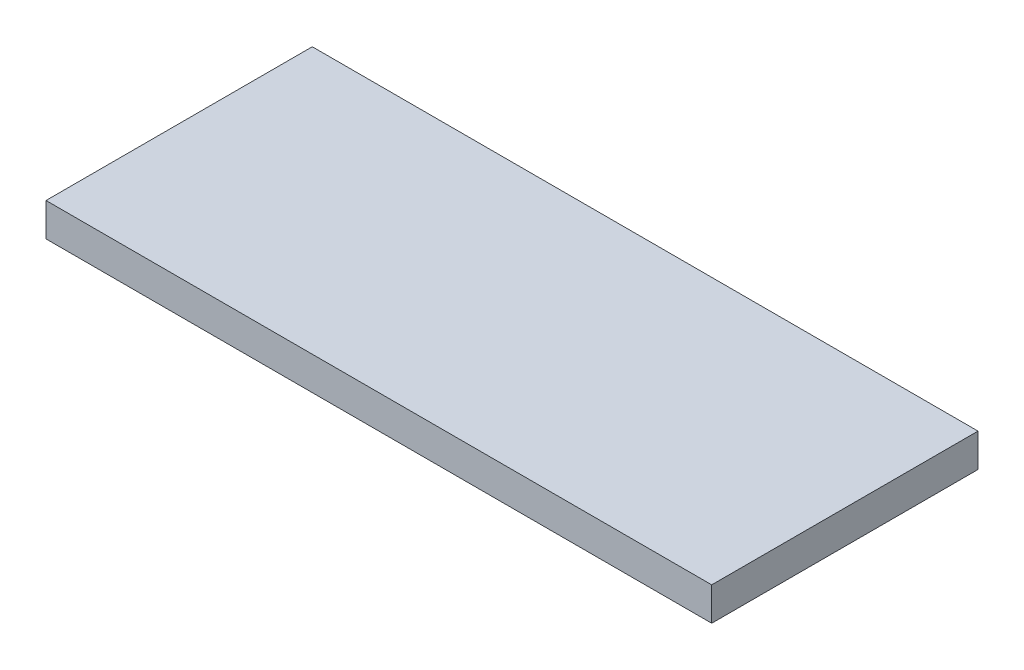
ISO-10303-21;
HEADER;
FILE_DESCRIPTION(('STEP AP214'),'2;1');
FILE_NAME('part.step','',(''),(''),'','','');
FILE_SCHEMA(('AUTOMOTIVE_DESIGN { 1 0 10303 214 1 1 1 1 }'));
ENDSEC;
DATA;
#1=APPLICATION_CONTEXT('core data for automotive mechanical design processes');
#2=APPLICATION_PROTOCOL_DEFINITION('international standard','automotive_design',2000,#1);
#3=PRODUCT_CONTEXT('',#1,'mechanical');
#4=PRODUCT('Part','Part','',(#3));
#5=PRODUCT_RELATED_PRODUCT_CATEGORY('part','',(#4));
#6=PRODUCT_DEFINITION_FORMATION('','',#4);
#7=PRODUCT_DEFINITION_CONTEXT('part definition',#1,'design');
#8=PRODUCT_DEFINITION('design','',#6,#7);
#9=PRODUCT_DEFINITION_SHAPE('','',#8);
#10=(LENGTH_UNIT() NAMED_UNIT(*) SI_UNIT(.MILLI.,.METRE.));
#11=(NAMED_UNIT(*) PLANE_ANGLE_UNIT() SI_UNIT($,.RADIAN.));
#12=(NAMED_UNIT(*) SI_UNIT($,.STERADIAN.) SOLID_ANGLE_UNIT());
#13=UNCERTAINTY_MEASURE_WITH_UNIT(LENGTH_MEASURE(1.E-05),#10,'distance_accuracy_value','');
#14=(GEOMETRIC_REPRESENTATION_CONTEXT(3) GLOBAL_UNCERTAINTY_ASSIGNED_CONTEXT((#13)) GLOBAL_UNIT_ASSIGNED_CONTEXT((#10,
#11,#12)) REPRESENTATION_CONTEXT('',''));
#15=CARTESIAN_POINT('',(0.,0.,0.));
#16=DIRECTION('',(0.,0.,1.));
#17=DIRECTION('',(1.,0.,0.));
#18=AXIS2_PLACEMENT_3D('',#15,#16,#17);
#19=CARTESIAN_POINT('',(-40.,4.,16.));
#20=DIRECTION('',(1.,0.,0.));
#21=DIRECTION('',(0.,0.,-1.));
#22=AXIS2_PLACEMENT_3D('',#19,#20,#21);
#23=PLANE('',#22);
#24=DIRECTION('',(0.,0.,1.));
#25=VECTOR('',#24,1.);
#26=CARTESIAN_POINT('',(-40.,0.,16.));
#27=LINE('',#26,#25);
#28=CARTESIAN_POINT('',(-40.,0.,-16.));
#29=VERTEX_POINT('',#28);
#30=CARTESIAN_POINT('',(-40.,0.,16.));
#31=VERTEX_POINT('',#30);
#32=EDGE_CURVE('E96',#29,#31,#27,.T.);
#33=ORIENTED_EDGE('',*,*,#32,.T.);
#34=DIRECTION('',(0.,-1.,0.));
#35=VECTOR('',#34,1.);
#36=CARTESIAN_POINT('',(-40.,4.,16.));
#37=LINE('',#36,#35);
#38=CARTESIAN_POINT('',(-40.,4.,16.));
#39=VERTEX_POINT('',#38);
#40=EDGE_CURVE('E11',#39,#31,#37,.T.);
#41=ORIENTED_EDGE('',*,*,#40,.F.);
#42=DIRECTION('',(0.,0.,1.));
#43=VECTOR('',#42,1.);
#44=CARTESIAN_POINT('',(-40.,4.,16.));
#45=LINE('',#44,#43);
#46=CARTESIAN_POINT('',(-40.,4.,-16.));
#47=VERTEX_POINT('',#46);
#48=EDGE_CURVE('E84',#47,#39,#45,.T.);
#49=ORIENTED_EDGE('',*,*,#48,.F.);
#50=DIRECTION('',(0.,-1.,0.));
#51=VECTOR('',#50,1.);
#52=CARTESIAN_POINT('',(-40.,4.,-16.));
#53=LINE('',#52,#51);
#54=EDGE_CURVE('E92',#47,#29,#53,.T.);
#55=ORIENTED_EDGE('',*,*,#54,.T.);
#56=EDGE_LOOP('',(#33,#41,#49,#55));
#57=FACE_BOUND('',#56,.T.);
#58=ADVANCED_FACE('F33',(#57),#23,.F.);
#59=CARTESIAN_POINT('',(40.,4.,16.));
#60=DIRECTION('',(0.,0.,-1.));
#61=DIRECTION('',(-1.,0.,0.));
#62=AXIS2_PLACEMENT_3D('',#59,#60,#61);
#63=PLANE('',#62);
#64=DIRECTION('',(1.,0.,0.));
#65=VECTOR('',#64,1.);
#66=CARTESIAN_POINT('',(40.,0.,16.));
#67=LINE('',#66,#65);
#68=CARTESIAN_POINT('',(40.,0.,16.));
#69=VERTEX_POINT('',#68);
#70=EDGE_CURVE('E88',#31,#69,#67,.T.);
#71=ORIENTED_EDGE('',*,*,#70,.T.);
#72=DIRECTION('',(0.,-1.,0.));
#73=VECTOR('',#72,1.);
#74=CARTESIAN_POINT('',(40.,4.,16.));
#75=LINE('',#74,#73);
#76=CARTESIAN_POINT('',(40.,4.,16.));
#77=VERTEX_POINT('',#76);
#78=EDGE_CURVE('E41',#77,#69,#75,.T.);
#79=ORIENTED_EDGE('',*,*,#78,.F.);
#80=DIRECTION('',(1.,0.,0.));
#81=VECTOR('',#80,1.);
#82=CARTESIAN_POINT('',(40.,4.,16.));
#83=LINE('',#82,#81);
#84=EDGE_CURVE('E79',#39,#77,#83,.T.);
#85=ORIENTED_EDGE('',*,*,#84,.F.);
#86=ORIENTED_EDGE('',*,*,#40,.T.);
#87=EDGE_LOOP('',(#71,#79,#85,#86));
#88=FACE_BOUND('',#87,.T.);
#89=ADVANCED_FACE('F87',(#88),#63,.F.);
#90=CARTESIAN_POINT('',(40.,4.,16.));
#91=DIRECTION('',(-1.,0.,0.));
#92=DIRECTION('',(0.,0.,1.));
#93=AXIS2_PLACEMENT_3D('',#90,#91,#92);
#94=PLANE('',#93);
#95=DIRECTION('',(0.,0.,-1.));
#96=VECTOR('',#95,1.);
#97=CARTESIAN_POINT('',(40.,0.,16.));
#98=LINE('',#97,#96);
#99=CARTESIAN_POINT('',(40.,0.,-16.));
#100=VERTEX_POINT('',#99);
#101=EDGE_CURVE('E66',#69,#100,#98,.T.);
#102=ORIENTED_EDGE('',*,*,#101,.T.);
#103=DIRECTION('',(0.,-1.,0.));
#104=VECTOR('',#103,1.);
#105=CARTESIAN_POINT('',(40.,4.,-16.));
#106=LINE('',#105,#104);
#107=CARTESIAN_POINT('',(40.,4.,-16.));
#108=VERTEX_POINT('',#107);
#109=EDGE_CURVE('E89',#108,#100,#106,.T.);
#110=ORIENTED_EDGE('',*,*,#109,.F.);
#111=DIRECTION('',(0.,0.,-1.));
#112=VECTOR('',#111,1.);
#113=CARTESIAN_POINT('',(40.,4.,16.));
#114=LINE('',#113,#112);
#115=EDGE_CURVE('E82',#77,#108,#114,.T.);
#116=ORIENTED_EDGE('',*,*,#115,.F.);
#117=ORIENTED_EDGE('',*,*,#78,.T.);
#118=EDGE_LOOP('',(#102,#110,#116,#117));
#119=FACE_BOUND('',#118,.T.);
#120=ADVANCED_FACE('F90',(#119),#94,.F.);
#121=CARTESIAN_POINT('',(40.,4.,-16.));
#122=DIRECTION('',(0.,0.,1.));
#123=DIRECTION('',(1.,0.,0.));
#124=AXIS2_PLACEMENT_3D('',#121,#122,#123);
#125=PLANE('',#124);
#126=DIRECTION('',(-1.,0.,0.));
#127=VECTOR('',#126,1.);
#128=CARTESIAN_POINT('',(40.,0.,-16.));
#129=LINE('',#128,#127);
#130=EDGE_CURVE('E72',#100,#29,#129,.T.);
#131=ORIENTED_EDGE('',*,*,#130,.T.);
#132=ORIENTED_EDGE('',*,*,#54,.F.);
#133=DIRECTION('',(-1.,0.,0.));
#134=VECTOR('',#133,1.);
#135=CARTESIAN_POINT('',(40.,4.,-16.));
#136=LINE('',#135,#134);
#137=EDGE_CURVE('E49',#108,#47,#136,.T.);
#138=ORIENTED_EDGE('',*,*,#137,.F.);
#139=ORIENTED_EDGE('',*,*,#109,.T.);
#140=EDGE_LOOP('',(#131,#132,#138,#139));
#141=FACE_BOUND('',#140,.T.);
#142=ADVANCED_FACE('F103',(#141),#125,.F.);
#143=CARTESIAN_POINT('',(0.,4.,0.));
#144=DIRECTION('',(0.,1.,0.));
#145=DIRECTION('',(0.,0.,1.));
#146=AXIS2_PLACEMENT_3D('',#143,#144,#145);
#147=PLANE('',#146);
#148=ORIENTED_EDGE('',*,*,#48,.T.);
#149=ORIENTED_EDGE('',*,*,#84,.T.);
#150=ORIENTED_EDGE('',*,*,#115,.T.);
#151=ORIENTED_EDGE('',*,*,#137,.T.);
#152=EDGE_LOOP('',(#148,#149,#150,#151));
#153=FACE_BOUND('',#152,.T.);
#154=ADVANCED_FACE('F80',(#153),#147,.T.);
#155=CARTESIAN_POINT('',(0.,0.,0.));
#156=DIRECTION('',(0.,1.,0.));
#157=DIRECTION('',(0.,0.,1.));
#158=AXIS2_PLACEMENT_3D('',#155,#156,#157);
#159=PLANE('',#158);
#160=ORIENTED_EDGE('',*,*,#32,.F.);
#161=ORIENTED_EDGE('',*,*,#130,.F.);
#162=ORIENTED_EDGE('',*,*,#101,.F.);
#163=ORIENTED_EDGE('',*,*,#70,.F.);
#164=EDGE_LOOP('',(#160,#161,#162,#163));
#165=FACE_BOUND('',#164,.T.);
#166=ADVANCED_FACE('F106',(#165),#159,.F.);
#167=CLOSED_SHELL('',(#58,#89,#120,#142,#154,#166));
#168=MANIFOLD_SOLID_BREP('B2',#167);
#169=ADVANCED_BREP_SHAPE_REPRESENTATION('',(#18,#168),#14);
#170=SHAPE_DEFINITION_REPRESENTATION(#9,#169);
ENDSEC;
END-ISO-10303-21;
